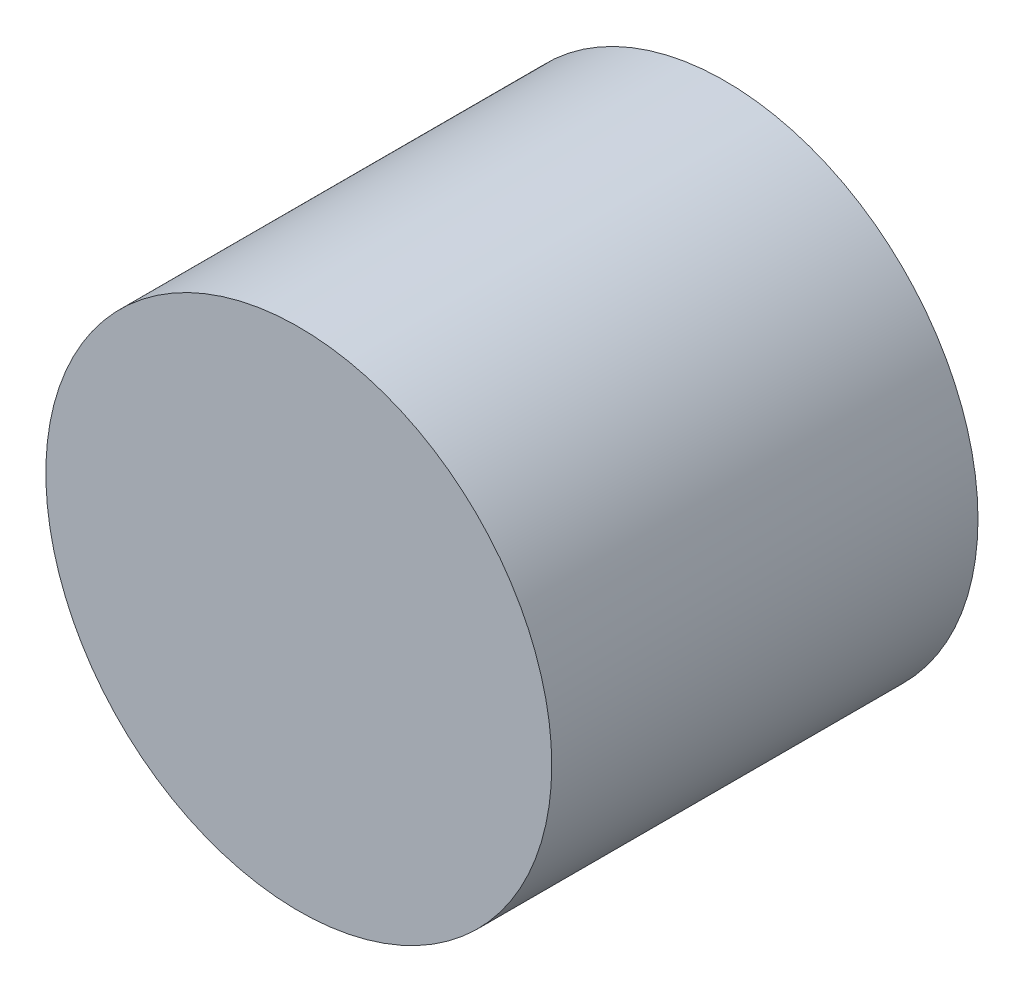
ISO-10303-21;
HEADER;
FILE_DESCRIPTION(('STEP AP214'),'2;1');
FILE_NAME('part.step','',(''),(''),'','','');
FILE_SCHEMA(('AUTOMOTIVE_DESIGN { 1 0 10303 214 1 1 1 1 }'));
ENDSEC;
DATA;
#1=APPLICATION_CONTEXT('core data for automotive mechanical design processes');
#2=APPLICATION_PROTOCOL_DEFINITION('international standard','automotive_design',2000,#1);
#3=PRODUCT_CONTEXT('',#1,'mechanical');
#4=PRODUCT('Part','Part','',(#3));
#5=PRODUCT_RELATED_PRODUCT_CATEGORY('part','',(#4));
#6=PRODUCT_DEFINITION_FORMATION('','',#4);
#7=PRODUCT_DEFINITION_CONTEXT('part definition',#1,'design');
#8=PRODUCT_DEFINITION('design','',#6,#7);
#9=PRODUCT_DEFINITION_SHAPE('','',#8);
#10=(LENGTH_UNIT() NAMED_UNIT(*) SI_UNIT(.MILLI.,.METRE.));
#11=(NAMED_UNIT(*) PLANE_ANGLE_UNIT() SI_UNIT($,.RADIAN.));
#12=(NAMED_UNIT(*) SI_UNIT($,.STERADIAN.) SOLID_ANGLE_UNIT());
#13=UNCERTAINTY_MEASURE_WITH_UNIT(LENGTH_MEASURE(1.E-05),#10,'distance_accuracy_value','');
#14=(GEOMETRIC_REPRESENTATION_CONTEXT(3) GLOBAL_UNCERTAINTY_ASSIGNED_CONTEXT((#13)) GLOBAL_UNIT_ASSIGNED_CONTEXT((#10,
#11,#12)) REPRESENTATION_CONTEXT('',''));
#15=CARTESIAN_POINT('',(0.,0.,0.));
#16=DIRECTION('',(0.,0.,1.));
#17=DIRECTION('',(1.,0.,0.));
#18=AXIS2_PLACEMENT_3D('',#15,#16,#17);
#19=CARTESIAN_POINT('',(0.,0.,107.));
#20=DIRECTION('',(0.,0.,-1.));
#21=DIRECTION('',(-1.,0.,0.));
#22=AXIS2_PLACEMENT_3D('',#19,#20,#21);
#23=CYLINDRICAL_SURFACE('',#22,63.5);
#24=CARTESIAN_POINT('',(0.,0.,107.));
#25=DIRECTION('',(0.,0.,1.));
#26=DIRECTION('',(1.,0.,0.));
#27=AXIS2_PLACEMENT_3D('',#24,#25,#26);
#28=CIRCLE('',#27,63.5);
#29=CARTESIAN_POINT('',(63.5,0.,107.));
#30=VERTEX_POINT('',#29);
#31=EDGE_CURVE('E10',#30,#30,#28,.T.);
#32=ORIENTED_EDGE('',*,*,#31,.F.);
#33=EDGE_LOOP('',(#32));
#34=FACE_BOUND('',#33,.T.);
#35=CARTESIAN_POINT('',(0.,0.,0.));
#36=DIRECTION('',(0.,0.,1.));
#37=DIRECTION('',(1.,0.,0.));
#38=AXIS2_PLACEMENT_3D('',#35,#36,#37);
#39=CIRCLE('',#38,63.5);
#40=CARTESIAN_POINT('',(63.5,0.,0.));
#41=VERTEX_POINT('',#40);
#42=EDGE_CURVE('E36',#41,#41,#39,.T.);
#43=ORIENTED_EDGE('',*,*,#42,.T.);
#44=EDGE_LOOP('',(#43));
#45=FACE_BOUND('',#44,.T.);
#46=ADVANCED_FACE('F33',(#34,#45),#23,.T.);
#47=CARTESIAN_POINT('',(0.,0.,107.));
#48=DIRECTION('',(0.,0.,1.));
#49=DIRECTION('',(1.,0.,0.));
#50=AXIS2_PLACEMENT_3D('',#47,#48,#49);
#51=PLANE('',#50);
#52=ORIENTED_EDGE('',*,*,#31,.T.);
#53=EDGE_LOOP('',(#52));
#54=FACE_BOUND('',#53,.T.);
#55=ADVANCED_FACE('F48',(#54),#51,.T.);
#56=CARTESIAN_POINT('',(0.,0.,0.));
#57=DIRECTION('',(0.,0.,1.));
#58=DIRECTION('',(1.,0.,0.));
#59=AXIS2_PLACEMENT_3D('',#56,#57,#58);
#60=PLANE('',#59);
#61=ORIENTED_EDGE('',*,*,#42,.F.);
#62=EDGE_LOOP('',(#61));
#63=FACE_BOUND('',#62,.T.);
#64=ADVANCED_FACE('F46',(#63),#60,.F.);
#65=CLOSED_SHELL('',(#46,#55,#64));
#66=MANIFOLD_SOLID_BREP('B2',#65);
#67=ADVANCED_BREP_SHAPE_REPRESENTATION('',(#18,#66),#14);
#68=SHAPE_DEFINITION_REPRESENTATION(#9,#67);
ENDSEC;
END-ISO-10303-21;
